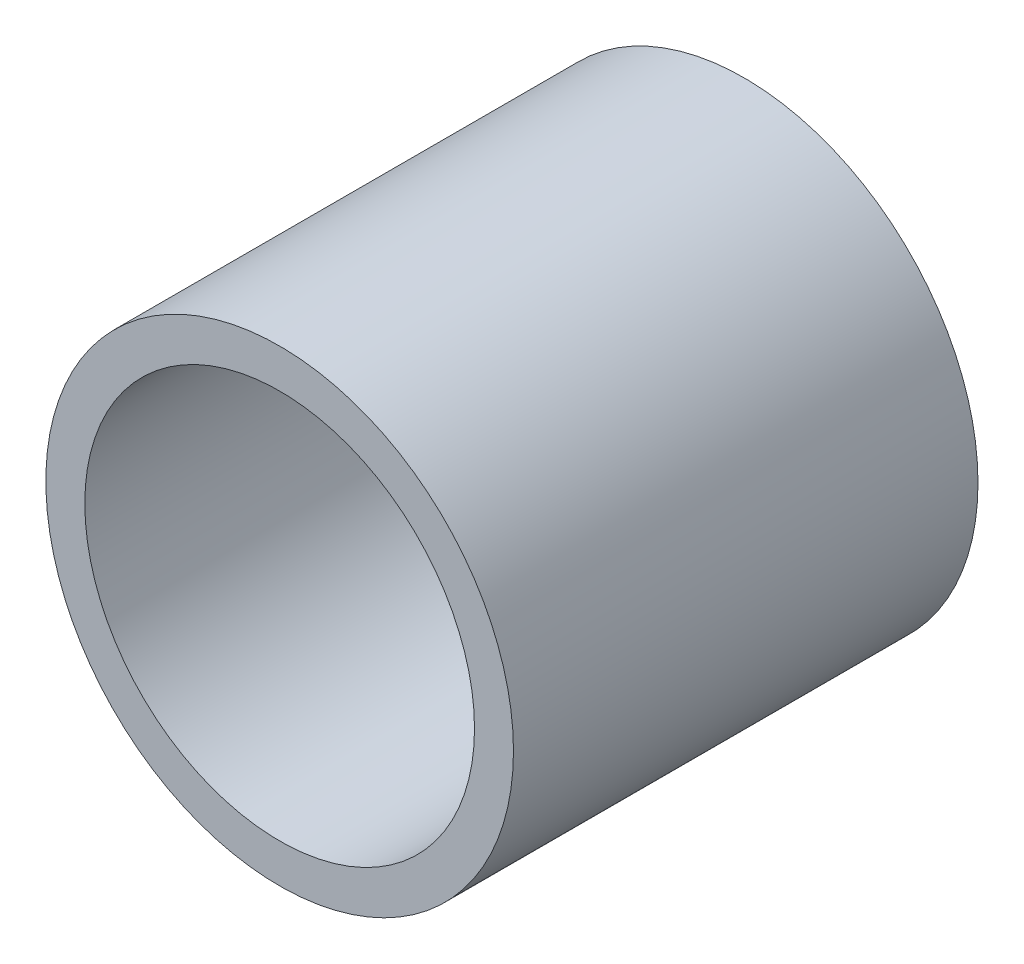
ISO-10303-21;
HEADER;
FILE_DESCRIPTION(('STEP AP214'),'2;1');
FILE_NAME('part.step','',(''),(''),'','','');
FILE_SCHEMA(('AUTOMOTIVE_DESIGN { 1 0 10303 214 1 1 1 1 }'));
ENDSEC;
DATA;
#1=APPLICATION_CONTEXT('core data for automotive mechanical design processes');
#2=APPLICATION_PROTOCOL_DEFINITION('international standard','automotive_design',2000,#1);
#3=PRODUCT_CONTEXT('',#1,'mechanical');
#4=PRODUCT('Part','Part','',(#3));
#5=PRODUCT_RELATED_PRODUCT_CATEGORY('part','',(#4));
#6=PRODUCT_DEFINITION_FORMATION('','',#4);
#7=PRODUCT_DEFINITION_CONTEXT('part definition',#1,'design');
#8=PRODUCT_DEFINITION('design','',#6,#7);
#9=PRODUCT_DEFINITION_SHAPE('','',#8);
#10=(LENGTH_UNIT() NAMED_UNIT(*) SI_UNIT(.MILLI.,.METRE.));
#11=(NAMED_UNIT(*) PLANE_ANGLE_UNIT() SI_UNIT($,.RADIAN.));
#12=(NAMED_UNIT(*) SI_UNIT($,.STERADIAN.) SOLID_ANGLE_UNIT());
#13=UNCERTAINTY_MEASURE_WITH_UNIT(LENGTH_MEASURE(1.E-05),#10,'distance_accuracy_value','');
#14=(GEOMETRIC_REPRESENTATION_CONTEXT(3) GLOBAL_UNCERTAINTY_ASSIGNED_CONTEXT((#13)) GLOBAL_UNIT_ASSIGNED_CONTEXT((#10,
#11,#12)) REPRESENTATION_CONTEXT('',''));
#15=CARTESIAN_POINT('',(0.,0.,0.));
#16=DIRECTION('',(0.,0.,1.));
#17=DIRECTION('',(1.,0.,0.));
#18=AXIS2_PLACEMENT_3D('',#15,#16,#17);
#19=CARTESIAN_POINT('',(0.,0.,-13.9994077035687));
#20=DIRECTION('',(0.,0.,1.));
#21=DIRECTION('',(1.,0.,0.));
#22=AXIS2_PLACEMENT_3D('',#19,#20,#21);
#23=CYLINDRICAL_SURFACE('',#22,7.9375);
#24=CARTESIAN_POINT('',(0.,0.,18.923));
#25=DIRECTION('',(0.,0.,1.));
#26=DIRECTION('',(1.,0.,0.));
#27=AXIS2_PLACEMENT_3D('',#24,#25,#26);
#28=CIRCLE('',#27,7.9375);
#29=CARTESIAN_POINT('',(7.9375,0.,18.923));
#30=VERTEX_POINT('',#29);
#31=EDGE_CURVE('E18',#30,#30,#28,.T.);
#32=ORIENTED_EDGE('',*,*,#31,.T.);
#33=EDGE_LOOP('',(#32));
#34=FACE_BOUND('',#33,.T.);
#35=CARTESIAN_POINT('',(0.,0.,0.));
#36=DIRECTION('',(0.,0.,1.));
#37=DIRECTION('',(1.,0.,0.));
#38=AXIS2_PLACEMENT_3D('',#35,#36,#37);
#39=CIRCLE('',#38,7.9375);
#40=CARTESIAN_POINT('',(7.9375,0.,0.));
#41=VERTEX_POINT('',#40);
#42=EDGE_CURVE('E27',#41,#41,#39,.T.);
#43=ORIENTED_EDGE('',*,*,#42,.F.);
#44=EDGE_LOOP('',(#43));
#45=FACE_BOUND('',#44,.T.);
#46=ADVANCED_FACE('F15',(#34,#45),#23,.F.);
#47=CARTESIAN_POINT('',(0.,0.,18.923));
#48=DIRECTION('',(0.,0.,-1.));
#49=DIRECTION('',(-1.,0.,0.));
#50=AXIS2_PLACEMENT_3D('',#47,#48,#49);
#51=PLANE('',#50);
#52=CARTESIAN_POINT('',(0.,0.,18.923));
#53=DIRECTION('',(0.,0.,1.));
#54=DIRECTION('',(1.,0.,0.));
#55=AXIS2_PLACEMENT_3D('',#52,#53,#54);
#56=CIRCLE('',#55,9.525);
#57=CARTESIAN_POINT('',(9.525,0.,18.923));
#58=VERTEX_POINT('',#57);
#59=EDGE_CURVE('E22',#58,#58,#56,.F.);
#60=ORIENTED_EDGE('',*,*,#59,.F.);
#61=EDGE_LOOP('',(#60));
#62=FACE_BOUND('',#61,.T.);
#63=ORIENTED_EDGE('',*,*,#31,.F.);
#64=EDGE_LOOP('',(#63));
#65=FACE_BOUND('',#64,.T.);
#66=ADVANCED_FACE('F37',(#62,#65),#51,.F.);
#67=CARTESIAN_POINT('',(0.,0.,0.));
#68=DIRECTION('',(0.,0.,-1.));
#69=DIRECTION('',(-1.,0.,0.));
#70=AXIS2_PLACEMENT_3D('',#67,#68,#69);
#71=PLANE('',#70);
#72=CARTESIAN_POINT('',(0.,0.,0.));
#73=DIRECTION('',(0.,0.,1.));
#74=DIRECTION('',(1.,0.,0.));
#75=AXIS2_PLACEMENT_3D('',#72,#73,#74);
#76=CIRCLE('',#75,9.525);
#77=CARTESIAN_POINT('',(9.525,0.,0.));
#78=VERTEX_POINT('',#77);
#79=EDGE_CURVE('E10',#78,#78,#76,.T.);
#80=ORIENTED_EDGE('',*,*,#79,.F.);
#81=EDGE_LOOP('',(#80));
#82=FACE_BOUND('',#81,.T.);
#83=ORIENTED_EDGE('',*,*,#42,.T.);
#84=EDGE_LOOP('',(#83));
#85=FACE_BOUND('',#84,.T.);
#86=ADVANCED_FACE('F39',(#82,#85),#71,.T.);
#87=CARTESIAN_POINT('',(0.,0.,0.));
#88=DIRECTION('',(0.,0.,1.));
#89=DIRECTION('',(1.,0.,0.));
#90=AXIS2_PLACEMENT_3D('',#87,#88,#89);
#91=CYLINDRICAL_SURFACE('',#90,9.525);
#92=ORIENTED_EDGE('',*,*,#79,.T.);
#93=EDGE_LOOP('',(#92));
#94=FACE_BOUND('',#93,.T.);
#95=ORIENTED_EDGE('',*,*,#59,.T.);
#96=EDGE_LOOP('',(#95));
#97=FACE_BOUND('',#96,.T.);
#98=ADVANCED_FACE('F46',(#94,#97),#91,.T.);
#99=CLOSED_SHELL('',(#46,#66,#86,#98));
#100=MANIFOLD_SOLID_BREP('B1',#99);
#101=ADVANCED_BREP_SHAPE_REPRESENTATION('',(#18,#100),#14);
#102=SHAPE_DEFINITION_REPRESENTATION(#9,#101);
ENDSEC;
END-ISO-10303-21;
